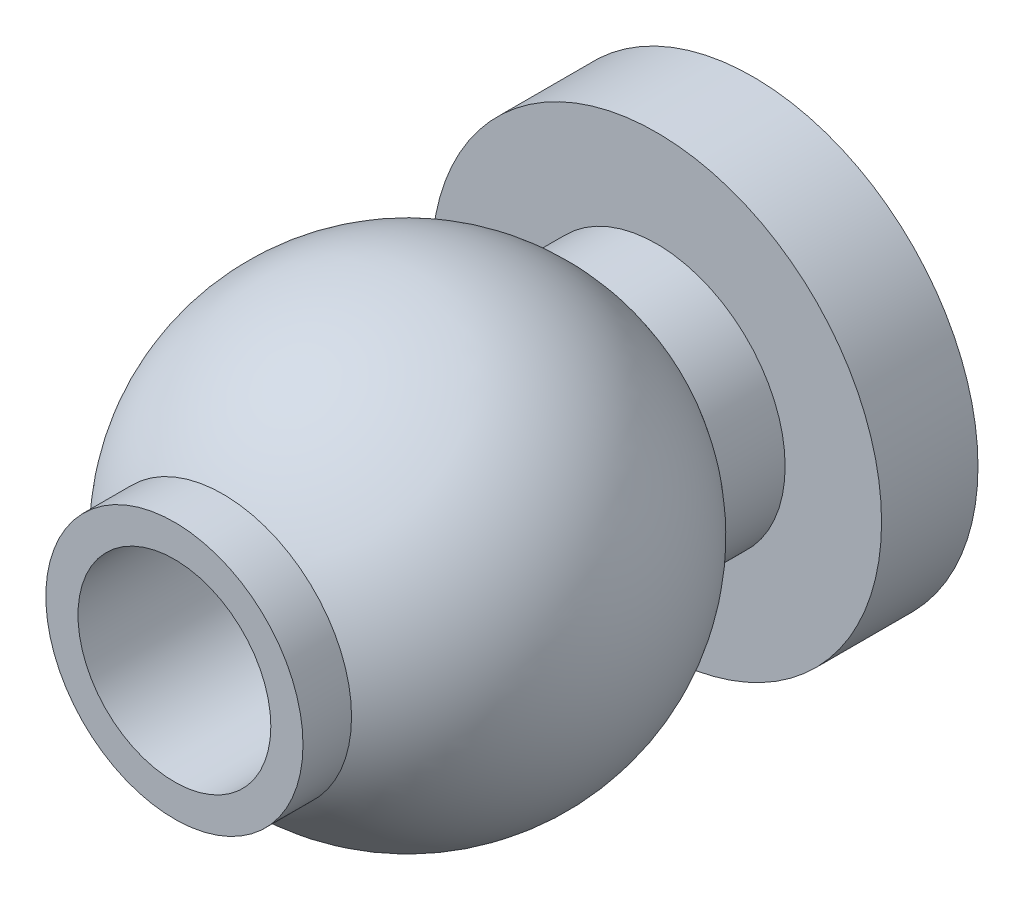
ISO-10303-21;
HEADER;
FILE_DESCRIPTION(('STEP AP214'),'2;1');
FILE_NAME('part.step','',(''),(''),'','','');
FILE_SCHEMA(('AUTOMOTIVE_DESIGN { 1 0 10303 214 1 1 1 1 }'));
ENDSEC;
DATA;
#1=APPLICATION_CONTEXT('core data for automotive mechanical design processes');
#2=APPLICATION_PROTOCOL_DEFINITION('international standard','automotive_design',2000,#1);
#3=PRODUCT_CONTEXT('',#1,'mechanical');
#4=PRODUCT('Part','Part','',(#3));
#5=PRODUCT_RELATED_PRODUCT_CATEGORY('part','',(#4));
#6=PRODUCT_DEFINITION_FORMATION('','',#4);
#7=PRODUCT_DEFINITION_CONTEXT('part definition',#1,'design');
#8=PRODUCT_DEFINITION('design','',#6,#7);
#9=PRODUCT_DEFINITION_SHAPE('','',#8);
#10=(LENGTH_UNIT() NAMED_UNIT(*) SI_UNIT(.MILLI.,.METRE.));
#11=(NAMED_UNIT(*) PLANE_ANGLE_UNIT() SI_UNIT($,.RADIAN.));
#12=(NAMED_UNIT(*) SI_UNIT($,.STERADIAN.) SOLID_ANGLE_UNIT());
#13=UNCERTAINTY_MEASURE_WITH_UNIT(LENGTH_MEASURE(1.E-05),#10,'distance_accuracy_value','');
#14=(GEOMETRIC_REPRESENTATION_CONTEXT(3) GLOBAL_UNCERTAINTY_ASSIGNED_CONTEXT((#13)) GLOBAL_UNIT_ASSIGNED_CONTEXT((#10,
#11,#12)) REPRESENTATION_CONTEXT('',''));
#15=CARTESIAN_POINT('',(0.,0.,0.));
#16=DIRECTION('',(0.,0.,1.));
#17=DIRECTION('',(1.,0.,0.));
#18=AXIS2_PLACEMENT_3D('',#15,#16,#17);
#19=CARTESIAN_POINT('',(0.,1.5,0.));
#20=DIRECTION('',(0.,0.,-1.));
#21=DIRECTION('',(-1.,0.,0.));
#22=AXIS2_PLACEMENT_3D('',#19,#20,#21);
#23=PLANE('',#22);
#24=CARTESIAN_POINT('',(0.,0.,0.));
#25=DIRECTION('',(0.,0.,1.));
#26=DIRECTION('',(1.,0.,0.));
#27=AXIS2_PLACEMENT_3D('',#24,#25,#26);
#28=CIRCLE('',#27,1.5);
#29=CARTESIAN_POINT('',(1.5,0.,0.));
#30=VERTEX_POINT('',#29);
#31=EDGE_CURVE('E10',#30,#30,#28,.T.);
#32=ORIENTED_EDGE('',*,*,#31,.F.);
#33=EDGE_LOOP('',(#32));
#34=FACE_BOUND('',#33,.T.);
#35=CARTESIAN_POINT('',(0.,0.,0.));
#36=DIRECTION('',(0.,0.,1.));
#37=DIRECTION('',(1.,0.,0.));
#38=AXIS2_PLACEMENT_3D('',#35,#36,#37);
#39=CIRCLE('',#38,2.);
#40=CARTESIAN_POINT('',(2.,0.,0.));
#41=VERTEX_POINT('',#40);
#42=EDGE_CURVE('E58',#41,#41,#39,.T.);
#43=ORIENTED_EDGE('',*,*,#42,.T.);
#44=EDGE_LOOP('',(#43));
#45=FACE_BOUND('',#44,.T.);
#46=ADVANCED_FACE('F30',(#34,#45),#23,.F.);
#47=CARTESIAN_POINT('',(0.,0.,0.));
#48=DIRECTION('',(0.,0.,1.));
#49=DIRECTION('',(1.,0.,0.));
#50=AXIS2_PLACEMENT_3D('',#47,#48,#49);
#51=CYLINDRICAL_SURFACE('',#50,1.5);
#52=CARTESIAN_POINT('',(0.,0.,-9.));
#53=DIRECTION('',(0.,0.,1.));
#54=DIRECTION('',(1.,0.,0.));
#55=AXIS2_PLACEMENT_3D('',#52,#53,#54);
#56=CIRCLE('',#55,1.5);
#57=CARTESIAN_POINT('',(1.5,0.,-9.));
#58=VERTEX_POINT('',#57);
#59=EDGE_CURVE('E36',#58,#58,#56,.T.);
#60=ORIENTED_EDGE('',*,*,#59,.F.);
#61=EDGE_LOOP('',(#60));
#62=FACE_BOUND('',#61,.T.);
#63=ORIENTED_EDGE('',*,*,#31,.T.);
#64=EDGE_LOOP('',(#63));
#65=FACE_BOUND('',#64,.T.);
#66=ADVANCED_FACE('F95',(#62,#65),#51,.F.);
#67=CARTESIAN_POINT('',(0.,1.5,-9.));
#68=DIRECTION('',(0.,0.,1.));
#69=DIRECTION('',(1.,0.,0.));
#70=AXIS2_PLACEMENT_3D('',#67,#68,#69);
#71=PLANE('',#70);
#72=CARTESIAN_POINT('',(0.,0.,-9.));
#73=DIRECTION('',(0.,0.,1.));
#74=DIRECTION('',(1.,0.,0.));
#75=AXIS2_PLACEMENT_3D('',#72,#73,#74);
#76=CIRCLE('',#75,3.5);
#77=CARTESIAN_POINT('',(3.5,0.,-9.));
#78=VERTEX_POINT('',#77);
#79=EDGE_CURVE('E40',#78,#78,#76,.T.);
#80=ORIENTED_EDGE('',*,*,#79,.F.);
#81=EDGE_LOOP('',(#80));
#82=FACE_BOUND('',#81,.T.);
#83=ORIENTED_EDGE('',*,*,#59,.T.);
#84=EDGE_LOOP('',(#83));
#85=FACE_BOUND('',#84,.T.);
#86=ADVANCED_FACE('F90',(#82,#85),#71,.F.);
#87=CARTESIAN_POINT('',(0.,0.,0.));
#88=DIRECTION('',(0.,0.,1.));
#89=DIRECTION('',(1.,0.,0.));
#90=AXIS2_PLACEMENT_3D('',#87,#88,#89);
#91=CYLINDRICAL_SURFACE('',#90,3.5);
#92=CARTESIAN_POINT('',(0.,0.,-7.5));
#93=DIRECTION('',(0.,0.,1.));
#94=DIRECTION('',(1.,0.,0.));
#95=AXIS2_PLACEMENT_3D('',#92,#93,#94);
#96=CIRCLE('',#95,3.5);
#97=CARTESIAN_POINT('',(3.5,0.,-7.5));
#98=VERTEX_POINT('',#97);
#99=EDGE_CURVE('E44',#98,#98,#96,.T.);
#100=ORIENTED_EDGE('',*,*,#99,.F.);
#101=EDGE_LOOP('',(#100));
#102=FACE_BOUND('',#101,.T.);
#103=ORIENTED_EDGE('',*,*,#79,.T.);
#104=EDGE_LOOP('',(#103));
#105=FACE_BOUND('',#104,.T.);
#106=ADVANCED_FACE('F84',(#102,#105),#91,.T.);
#107=CARTESIAN_POINT('',(0.,3.5,-7.5));
#108=DIRECTION('',(0.,0.,-1.));
#109=DIRECTION('',(-1.,0.,0.));
#110=AXIS2_PLACEMENT_3D('',#107,#108,#109);
#111=PLANE('',#110);
#112=CARTESIAN_POINT('',(0.,0.,-7.5));
#113=DIRECTION('',(0.,0.,1.));
#114=DIRECTION('',(1.,0.,0.));
#115=AXIS2_PLACEMENT_3D('',#112,#113,#114);
#116=CIRCLE('',#115,2.);
#117=CARTESIAN_POINT('',(2.,0.,-7.5));
#118=VERTEX_POINT('',#117);
#119=EDGE_CURVE('E49',#118,#118,#116,.T.);
#120=ORIENTED_EDGE('',*,*,#119,.F.);
#121=EDGE_LOOP('',(#120));
#122=FACE_BOUND('',#121,.T.);
#123=ORIENTED_EDGE('',*,*,#99,.T.);
#124=EDGE_LOOP('',(#123));
#125=FACE_BOUND('',#124,.T.);
#126=ADVANCED_FACE('F78',(#122,#125),#111,.F.);
#127=CARTESIAN_POINT('',(0.,0.,0.));
#128=DIRECTION('',(0.,0.,1.));
#129=DIRECTION('',(1.,0.,0.));
#130=AXIS2_PLACEMENT_3D('',#127,#128,#129);
#131=CYLINDRICAL_SURFACE('',#130,2.);
#132=CARTESIAN_POINT('',(0.,0.,-6.5));
#133=DIRECTION('',(0.,0.,1.));
#134=DIRECTION('',(1.,0.,0.));
#135=AXIS2_PLACEMENT_3D('',#132,#133,#134);
#136=CIRCLE('',#135,2.);
#137=CARTESIAN_POINT('',(2.,0.,-6.5));
#138=VERTEX_POINT('',#137);
#139=EDGE_CURVE('E52',#138,#138,#136,.T.);
#140=ORIENTED_EDGE('',*,*,#139,.F.);
#141=EDGE_LOOP('',(#140));
#142=FACE_BOUND('',#141,.T.);
#143=ORIENTED_EDGE('',*,*,#119,.T.);
#144=EDGE_LOOP('',(#143));
#145=FACE_BOUND('',#144,.T.);
#146=ADVANCED_FACE('F72',(#142,#145),#131,.T.);
#147=CARTESIAN_POINT('',(0.,0.,-3.62771867673099));
#148=DIRECTION('',(0.,0.,1.));
#149=DIRECTION('',(0.,1.,0.));
#150=AXIS2_PLACEMENT_3D('',#147,#148,#149);
#151=SPHERICAL_SURFACE('',#150,3.5);
#152=CARTESIAN_POINT('',(0.,0.,-0.755437353461972));
#153=DIRECTION('',(0.,0.,1.));
#154=DIRECTION('',(1.,0.,0.));
#155=AXIS2_PLACEMENT_3D('',#152,#153,#154);
#156=CIRCLE('',#155,2.);
#157=CARTESIAN_POINT('',(2.,0.,-0.755437353461972));
#158=VERTEX_POINT('',#157);
#159=EDGE_CURVE('E55',#158,#158,#156,.T.);
#160=ORIENTED_EDGE('',*,*,#159,.F.);
#161=EDGE_LOOP('',(#160));
#162=FACE_BOUND('',#161,.T.);
#163=ORIENTED_EDGE('',*,*,#139,.T.);
#164=EDGE_LOOP('',(#163));
#165=FACE_BOUND('',#164,.T.);
#166=ADVANCED_FACE('F66',(#162,#165),#151,.T.);
#167=CARTESIAN_POINT('',(0.,0.,0.));
#168=DIRECTION('',(0.,0.,1.));
#169=DIRECTION('',(1.,0.,0.));
#170=AXIS2_PLACEMENT_3D('',#167,#168,#169);
#171=CYLINDRICAL_SURFACE('',#170,2.);
#172=ORIENTED_EDGE('',*,*,#42,.F.);
#173=EDGE_LOOP('',(#172));
#174=FACE_BOUND('',#173,.T.);
#175=ORIENTED_EDGE('',*,*,#159,.T.);
#176=EDGE_LOOP('',(#175));
#177=FACE_BOUND('',#176,.T.);
#178=ADVANCED_FACE('F63',(#174,#177),#171,.T.);
#179=CLOSED_SHELL('',(#46,#66,#86,#106,#126,#146,#166,#178));
#180=MANIFOLD_SOLID_BREP('B2',#179);
#181=ADVANCED_BREP_SHAPE_REPRESENTATION('',(#18,#180),#14);
#182=SHAPE_DEFINITION_REPRESENTATION(#9,#181);
ENDSEC;
END-ISO-10303-21;
